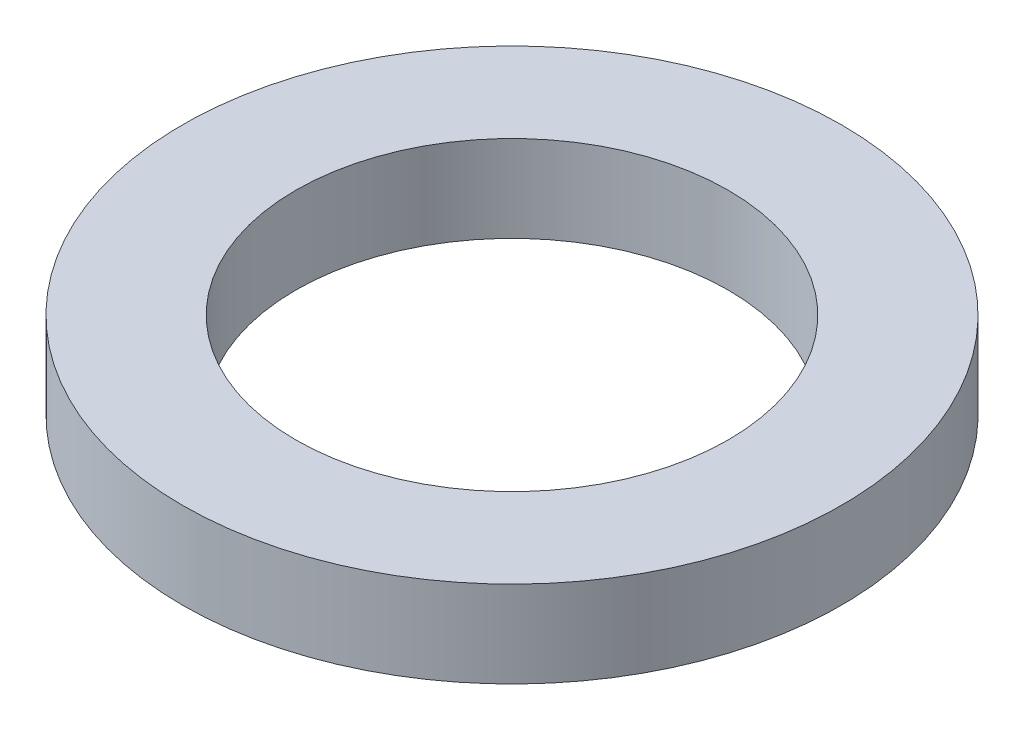
ISO-10303-21;
HEADER;
FILE_DESCRIPTION(('STEP AP214'),'2;1');
FILE_NAME('part.step','',(''),(''),'','','');
FILE_SCHEMA(('AUTOMOTIVE_DESIGN { 1 0 10303 214 1 1 1 1 }'));
ENDSEC;
DATA;
#1=APPLICATION_CONTEXT('core data for automotive mechanical design processes');
#2=APPLICATION_PROTOCOL_DEFINITION('international standard','automotive_design',2000,#1);
#3=PRODUCT_CONTEXT('',#1,'mechanical');
#4=PRODUCT('Part','Part','',(#3));
#5=PRODUCT_RELATED_PRODUCT_CATEGORY('part','',(#4));
#6=PRODUCT_DEFINITION_FORMATION('','',#4);
#7=PRODUCT_DEFINITION_CONTEXT('part definition',#1,'design');
#8=PRODUCT_DEFINITION('design','',#6,#7);
#9=PRODUCT_DEFINITION_SHAPE('','',#8);
#10=(LENGTH_UNIT() NAMED_UNIT(*) SI_UNIT(.MILLI.,.METRE.));
#11=(NAMED_UNIT(*) PLANE_ANGLE_UNIT() SI_UNIT($,.RADIAN.));
#12=(NAMED_UNIT(*) SI_UNIT($,.STERADIAN.) SOLID_ANGLE_UNIT());
#13=UNCERTAINTY_MEASURE_WITH_UNIT(LENGTH_MEASURE(1.E-05),#10,'distance_accuracy_value','');
#14=(GEOMETRIC_REPRESENTATION_CONTEXT(3) GLOBAL_UNCERTAINTY_ASSIGNED_CONTEXT((#13)) GLOBAL_UNIT_ASSIGNED_CONTEXT((#10,
#11,#12)) REPRESENTATION_CONTEXT('',''));
#15=CARTESIAN_POINT('',(0.,0.,0.));
#16=DIRECTION('',(0.,0.,1.));
#17=DIRECTION('',(1.,0.,0.));
#18=AXIS2_PLACEMENT_3D('',#15,#16,#17);
#19=CARTESIAN_POINT('',(6.25000000000001,0.,0.));
#20=DIRECTION('',(0.,1.,0.));
#21=DIRECTION('',(0.,0.,1.));
#22=AXIS2_PLACEMENT_3D('',#19,#20,#21);
#23=PLANE('',#22);
#24=CARTESIAN_POINT('',(0.,0.,0.));
#25=DIRECTION('',(0.,1.,0.));
#26=DIRECTION('',(0.,0.,1.));
#27=AXIS2_PLACEMENT_3D('',#24,#25,#26);
#28=CIRCLE('',#27,9.52500000000001);
#29=CARTESIAN_POINT('',(0.,0.,9.52500000000001));
#30=VERTEX_POINT('',#29);
#31=EDGE_CURVE('E10',#30,#30,#28,.T.);
#32=ORIENTED_EDGE('',*,*,#31,.F.);
#33=EDGE_LOOP('',(#32));
#34=FACE_BOUND('',#33,.T.);
#35=CARTESIAN_POINT('',(0.,0.,0.));
#36=DIRECTION('',(0.,1.,0.));
#37=DIRECTION('',(0.,0.,1.));
#38=AXIS2_PLACEMENT_3D('',#35,#36,#37);
#39=CIRCLE('',#38,6.25000000000001);
#40=CARTESIAN_POINT('',(0.,0.,6.25000000000001));
#41=VERTEX_POINT('',#40);
#42=EDGE_CURVE('E51',#41,#41,#39,.T.);
#43=ORIENTED_EDGE('',*,*,#42,.T.);
#44=EDGE_LOOP('',(#43));
#45=FACE_BOUND('',#44,.T.);
#46=ADVANCED_FACE('F37',(#34,#45),#23,.F.);
#47=CARTESIAN_POINT('',(0.,77.1441422656178,0.));
#48=DIRECTION('',(0.,1.,0.));
#49=DIRECTION('',(0.,0.,1.));
#50=AXIS2_PLACEMENT_3D('',#47,#48,#49);
#51=CYLINDRICAL_SURFACE('',#50,9.52500000000001);
#52=CARTESIAN_POINT('',(0.,2.5,0.));
#53=DIRECTION('',(0.,1.,0.));
#54=DIRECTION('',(0.,0.,1.));
#55=AXIS2_PLACEMENT_3D('',#52,#53,#54);
#56=CIRCLE('',#55,9.52500000000001);
#57=CARTESIAN_POINT('',(0.,2.5,9.52500000000001));
#58=VERTEX_POINT('',#57);
#59=EDGE_CURVE('E43',#58,#58,#56,.T.);
#60=ORIENTED_EDGE('',*,*,#59,.F.);
#61=EDGE_LOOP('',(#60));
#62=FACE_BOUND('',#61,.T.);
#63=ORIENTED_EDGE('',*,*,#31,.T.);
#64=EDGE_LOOP('',(#63));
#65=FACE_BOUND('',#64,.T.);
#66=ADVANCED_FACE('F66',(#62,#65),#51,.T.);
#67=CARTESIAN_POINT('',(6.25000000000001,2.5,0.));
#68=DIRECTION('',(0.,-1.,0.));
#69=DIRECTION('',(0.,0.,-1.));
#70=AXIS2_PLACEMENT_3D('',#67,#68,#69);
#71=PLANE('',#70);
#72=CARTESIAN_POINT('',(0.,2.5,0.));
#73=DIRECTION('',(0.,1.,0.));
#74=DIRECTION('',(0.,0.,1.));
#75=AXIS2_PLACEMENT_3D('',#72,#73,#74);
#76=CIRCLE('',#75,6.25000000000001);
#77=CARTESIAN_POINT('',(0.,2.5,6.25000000000001));
#78=VERTEX_POINT('',#77);
#79=EDGE_CURVE('E47',#78,#78,#76,.T.);
#80=ORIENTED_EDGE('',*,*,#79,.F.);
#81=EDGE_LOOP('',(#80));
#82=FACE_BOUND('',#81,.T.);
#83=ORIENTED_EDGE('',*,*,#59,.T.);
#84=EDGE_LOOP('',(#83));
#85=FACE_BOUND('',#84,.T.);
#86=ADVANCED_FACE('F61',(#82,#85),#71,.F.);
#87=CARTESIAN_POINT('',(0.,77.1441422656178,0.));
#88=DIRECTION('',(0.,1.,0.));
#89=DIRECTION('',(0.,0.,1.));
#90=AXIS2_PLACEMENT_3D('',#87,#88,#89);
#91=CYLINDRICAL_SURFACE('',#90,6.25000000000001);
#92=ORIENTED_EDGE('',*,*,#42,.F.);
#93=EDGE_LOOP('',(#92));
#94=FACE_BOUND('',#93,.T.);
#95=ORIENTED_EDGE('',*,*,#79,.T.);
#96=EDGE_LOOP('',(#95));
#97=FACE_BOUND('',#96,.T.);
#98=ADVANCED_FACE('F58',(#94,#97),#91,.F.);
#99=CLOSED_SHELL('',(#46,#66,#86,#98));
#100=MANIFOLD_SOLID_BREP('B2',#99);
#101=ADVANCED_BREP_SHAPE_REPRESENTATION('',(#18,#100),#14);
#102=SHAPE_DEFINITION_REPRESENTATION(#9,#101);
ENDSEC;
END-ISO-10303-21;
